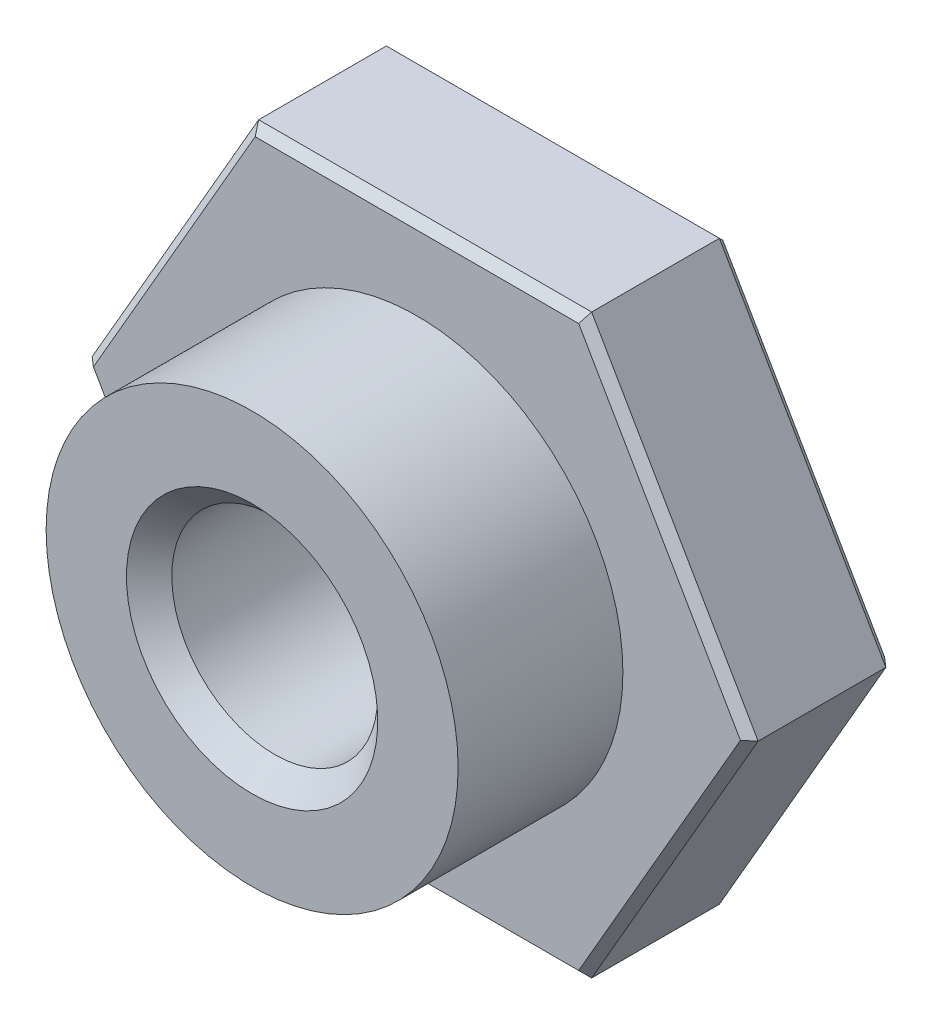
ISO-10303-21;
HEADER;
FILE_DESCRIPTION(('STEP AP214'),'2;1');
FILE_NAME('part.step','',(''),(''),'','','');
FILE_SCHEMA(('AUTOMOTIVE_DESIGN { 1 0 10303 214 1 1 1 1 }'));
ENDSEC;
DATA;
#1=APPLICATION_CONTEXT('core data for automotive mechanical design processes');
#2=APPLICATION_PROTOCOL_DEFINITION('international standard','automotive_design',2000,#1);
#3=PRODUCT_CONTEXT('',#1,'mechanical');
#4=PRODUCT('Part','Part','',(#3));
#5=PRODUCT_RELATED_PRODUCT_CATEGORY('part','',(#4));
#6=PRODUCT_DEFINITION_FORMATION('','',#4);
#7=PRODUCT_DEFINITION_CONTEXT('part definition',#1,'design');
#8=PRODUCT_DEFINITION('design','',#6,#7);
#9=PRODUCT_DEFINITION_SHAPE('','',#8);
#10=(LENGTH_UNIT() NAMED_UNIT(*) SI_UNIT(.MILLI.,.METRE.));
#11=(NAMED_UNIT(*) PLANE_ANGLE_UNIT() SI_UNIT($,.RADIAN.));
#12=(NAMED_UNIT(*) SI_UNIT($,.STERADIAN.) SOLID_ANGLE_UNIT());
#13=UNCERTAINTY_MEASURE_WITH_UNIT(LENGTH_MEASURE(1.E-05),#10,'distance_accuracy_value','');
#14=(GEOMETRIC_REPRESENTATION_CONTEXT(3) GLOBAL_UNCERTAINTY_ASSIGNED_CONTEXT((#13)) GLOBAL_UNIT_ASSIGNED_CONTEXT((#10,
#11,#12)) REPRESENTATION_CONTEXT('',''));
#15=CARTESIAN_POINT('',(0.,0.,0.));
#16=DIRECTION('',(0.,0.,1.));
#17=DIRECTION('',(1.,0.,0.));
#18=AXIS2_PLACEMENT_3D('',#15,#16,#17);
#19=CARTESIAN_POINT('',(0.,0.,3.75));
#20=DIRECTION('',(0.,0.,-1.));
#21=DIRECTION('',(-1.,0.,0.));
#22=AXIS2_PLACEMENT_3D('',#19,#20,#21);
#23=CYLINDRICAL_SURFACE('',#22,2.5);
#24=CARTESIAN_POINT('',(0.,0.,1.75));
#25=DIRECTION('',(0.,0.,-1.));
#26=DIRECTION('',(-1.,0.,0.));
#27=AXIS2_PLACEMENT_3D('',#24,#25,#26);
#28=CIRCLE('',#27,2.5);
#29=CARTESIAN_POINT('',(-2.5,0.,1.75));
#30=VERTEX_POINT('',#29);
#31=EDGE_CURVE('E19',#30,#30,#28,.T.);
#32=ORIENTED_EDGE('',*,*,#31,.F.);
#33=EDGE_LOOP('',(#32));
#34=FACE_BOUND('',#33,.T.);
#35=CARTESIAN_POINT('',(0.,0.,3.75));
#36=DIRECTION('',(0.,0.,-1.));
#37=DIRECTION('',(-1.,0.,0.));
#38=AXIS2_PLACEMENT_3D('',#35,#36,#37);
#39=CIRCLE('',#38,2.5);
#40=CARTESIAN_POINT('',(-2.5,0.,3.75));
#41=VERTEX_POINT('',#40);
#42=EDGE_CURVE('E118',#41,#41,#39,.F.);
#43=ORIENTED_EDGE('',*,*,#42,.F.);
#44=EDGE_LOOP('',(#43));
#45=FACE_BOUND('',#44,.T.);
#46=ADVANCED_FACE('F16',(#34,#45),#23,.T.);
#47=CARTESIAN_POINT('',(0.,0.,1.75));
#48=DIRECTION('',(0.,0.,1.));
#49=DIRECTION('',(1.,0.,0.));
#50=AXIS2_PLACEMENT_3D('',#47,#48,#49);
#51=PLANE('',#50);
#52=ORIENTED_EDGE('',*,*,#31,.T.);
#53=EDGE_LOOP('',(#52));
#54=FACE_BOUND('',#53,.T.);
#55=DIRECTION('',(1.,0.,0.));
#56=VECTOR('',#55,1.);
#57=CARTESIAN_POINT('',(0.,-3.4,1.75));
#58=LINE('',#57,#56);
#59=CARTESIAN_POINT('',(1.96299091524473,-3.4,1.75));
#60=VERTEX_POINT('',#59);
#61=CARTESIAN_POINT('',(-1.96299091524473,-3.4,1.75));
#62=VERTEX_POINT('',#61);
#63=EDGE_CURVE('E111',#60,#62,#58,.F.);
#64=ORIENTED_EDGE('',*,*,#63,.F.);
#65=DIRECTION('',(-0.5,-0.866025403784438,0.));
#66=VECTOR('',#65,1.);
#67=CARTESIAN_POINT('',(3.92598183048946,0.,1.75));
#68=LINE('',#67,#66);
#69=CARTESIAN_POINT('',(3.92598183048946,0.,1.75));
#70=VERTEX_POINT('',#69);
#71=EDGE_CURVE('E108',#70,#60,#68,.T.);
#72=ORIENTED_EDGE('',*,*,#71,.F.);
#73=DIRECTION('',(0.5,-0.866025403784439,0.));
#74=VECTOR('',#73,1.);
#75=CARTESIAN_POINT('',(1.96299091524473,3.4,1.75));
#76=LINE('',#75,#74);
#77=CARTESIAN_POINT('',(1.96299091524473,3.4,1.75));
#78=VERTEX_POINT('',#77);
#79=EDGE_CURVE('E105',#78,#70,#76,.T.);
#80=ORIENTED_EDGE('',*,*,#79,.F.);
#81=DIRECTION('',(1.,0.,0.));
#82=VECTOR('',#81,1.);
#83=CARTESIAN_POINT('',(0.,3.4,1.75));
#84=LINE('',#83,#82);
#85=CARTESIAN_POINT('',(-1.96299091524473,3.4,1.75));
#86=VERTEX_POINT('',#85);
#87=EDGE_CURVE('E292',#86,#78,#84,.T.);
#88=ORIENTED_EDGE('',*,*,#87,.F.);
#89=DIRECTION('',(0.5,0.866025403784439,0.));
#90=VECTOR('',#89,1.);
#91=CARTESIAN_POINT('',(-3.92598183048946,0.,1.75));
#92=LINE('',#91,#90);
#93=CARTESIAN_POINT('',(-3.92598183048946,0.,1.75));
#94=VERTEX_POINT('',#93);
#95=EDGE_CURVE('E289',#94,#86,#92,.T.);
#96=ORIENTED_EDGE('',*,*,#95,.F.);
#97=DIRECTION('',(-0.5,0.866025403784439,0.));
#98=VECTOR('',#97,1.);
#99=CARTESIAN_POINT('',(-1.96299091524473,-3.4,1.75));
#100=LINE('',#99,#98);
#101=EDGE_CURVE('E283',#62,#94,#100,.T.);
#102=ORIENTED_EDGE('',*,*,#101,.F.);
#103=EDGE_LOOP('',(#64,#72,#80,#88,#96,#102));
#104=FACE_BOUND('',#103,.T.);
#105=ADVANCED_FACE('F109',(#54,#104),#51,.T.);
#106=CARTESIAN_POINT('',(0.,0.,3.75));
#107=DIRECTION('',(0.,0.,1.));
#108=DIRECTION('',(1.,0.,0.));
#109=AXIS2_PLACEMENT_3D('',#106,#107,#108);
#110=PLANE('',#109);
#111=ORIENTED_EDGE('',*,*,#42,.T.);
#112=EDGE_LOOP('',(#111));
#113=FACE_BOUND('',#112,.T.);
#114=CARTESIAN_POINT('',(0.,0.,3.75000000002501));
#115=DIRECTION('',(0.,0.,1.));
#116=DIRECTION('',(0.,-1.,0.));
#117=AXIS2_PLACEMENT_3D('',#114,#115,#116);
#118=CIRCLE('',#117,1.52499999995825);
#119=CARTESIAN_POINT('',(0.,-1.52499999995825,3.75000000002501));
#120=VERTEX_POINT('',#119);
#121=EDGE_CURVE('E139',#120,#120,#118,.F.);
#122=ORIENTED_EDGE('',*,*,#121,.T.);
#123=EDGE_LOOP('',(#122));
#124=FACE_BOUND('',#123,.T.);
#125=ADVANCED_FACE('F160',(#113,#124),#110,.T.);
#126=CARTESIAN_POINT('',(2.94448637286709,-1.7,1.75));
#127=DIRECTION('',(0.612372435695797,-0.353553390593275,0.707106781186545));
#128=DIRECTION('',(0.755928946018452,0.,-0.65465367070798));
#129=AXIS2_PLACEMENT_3D('',#126,#127,#128);
#130=PLANE('',#129);
#131=DIRECTION('',(0.75592894601845,0.,-0.654653670707982));
#132=VECTOR('',#131,1.);
#133=CARTESIAN_POINT('',(3.36512728327668,0.,2.23571428571429));
#134=LINE('',#133,#132);
#135=CARTESIAN_POINT('',(4.04145188432738,0.,1.65));
#136=VERTEX_POINT('',#135);
#137=EDGE_CURVE('E117',#70,#136,#134,.T.);
#138=ORIENTED_EDGE('',*,*,#137,.F.);
#139=ORIENTED_EDGE('',*,*,#71,.T.);
#140=DIRECTION('',(-0.377964473009232,0.654653670707973,0.654653670707978));
#141=VECTOR('',#140,1.);
#142=CARTESIAN_POINT('',(2.02072594216369,-3.5,1.65));
#143=LINE('',#142,#141);
#144=CARTESIAN_POINT('',(2.02072594216369,-3.5,1.65));
#145=VERTEX_POINT('',#144);
#146=EDGE_CURVE('E275',#145,#60,#143,.T.);
#147=ORIENTED_EDGE('',*,*,#146,.F.);
#148=DIRECTION('',(-0.5,-0.866025403784439,0.));
#149=VECTOR('',#148,1.);
#150=CARTESIAN_POINT('',(2.02072594216369,-3.5,1.65));
#151=LINE('',#150,#149);
#152=EDGE_CURVE('E130',#145,#136,#151,.F.);
#153=ORIENTED_EDGE('',*,*,#152,.T.);
#154=EDGE_LOOP('',(#138,#139,#147,#153));
#155=FACE_BOUND('',#154,.T.);
#156=ADVANCED_FACE('F129',(#155),#130,.T.);
#157=CARTESIAN_POINT('',(2.94448637286709,1.7,1.75));
#158=DIRECTION('',(0.612372435695799,0.353553390593276,0.707106781186543));
#159=DIRECTION('',(0.75592894601845,0.,-0.654653670707982));
#160=AXIS2_PLACEMENT_3D('',#157,#158,#159);
#161=PLANE('',#160);
#162=DIRECTION('',(0.377964473009223,0.654653670707976,-0.654653670707981));
#163=VECTOR('',#162,1.);
#164=CARTESIAN_POINT('',(1.96299091524473,3.4,1.75));
#165=LINE('',#164,#163);
#166=CARTESIAN_POINT('',(2.02072594216369,3.5,1.65));
#167=VERTEX_POINT('',#166);
#168=EDGE_CURVE('E125',#78,#167,#165,.T.);
#169=ORIENTED_EDGE('',*,*,#168,.F.);
#170=ORIENTED_EDGE('',*,*,#79,.T.);
#171=ORIENTED_EDGE('',*,*,#137,.T.);
#172=DIRECTION('',(0.5,-0.866025403784439,0.));
#173=VECTOR('',#172,1.);
#174=CARTESIAN_POINT('',(4.04145188432738,0.,1.65));
#175=LINE('',#174,#173);
#176=EDGE_CURVE('E310',#136,#167,#175,.F.);
#177=ORIENTED_EDGE('',*,*,#176,.T.);
#178=EDGE_LOOP('',(#169,#170,#171,#177));
#179=FACE_BOUND('',#178,.T.);
#180=ADVANCED_FACE('F122',(#179),#161,.T.);
#181=CARTESIAN_POINT('',(0.,3.4,1.75));
#182=DIRECTION('',(0.,0.707106781186551,0.707106781186544));
#183=DIRECTION('',(0.,-0.707106781186544,0.707106781186551));
#184=AXIS2_PLACEMENT_3D('',#181,#182,#183);
#185=PLANE('',#184);
#186=DIRECTION('',(-0.377964473009226,0.654653670707975,-0.65465367070798));
#187=VECTOR('',#186,1.);
#188=CARTESIAN_POINT('',(-1.96299091524473,3.4,1.75));
#189=LINE('',#188,#187);
#190=CARTESIAN_POINT('',(-2.02072594216369,3.5,1.65));
#191=VERTEX_POINT('',#190);
#192=EDGE_CURVE('E286',#86,#191,#189,.T.);
#193=ORIENTED_EDGE('',*,*,#192,.F.);
#194=ORIENTED_EDGE('',*,*,#87,.T.);
#195=ORIENTED_EDGE('',*,*,#168,.T.);
#196=DIRECTION('',(1.,0.,0.));
#197=VECTOR('',#196,1.);
#198=CARTESIAN_POINT('',(2.02072594216369,3.5,1.65));
#199=LINE('',#198,#197);
#200=EDGE_CURVE('E300',#167,#191,#199,.F.);
#201=ORIENTED_EDGE('',*,*,#200,.T.);
#202=EDGE_LOOP('',(#193,#194,#195,#201));
#203=FACE_BOUND('',#202,.T.);
#204=ADVANCED_FACE('F240',(#203),#185,.T.);
#205=CARTESIAN_POINT('',(-2.94448637286709,1.7,1.75));
#206=DIRECTION('',(-0.612372435695797,0.353553390593276,0.707106781186544));
#207=DIRECTION('',(0.755928946018451,0.,0.654653670707981));
#208=AXIS2_PLACEMENT_3D('',#205,#206,#207);
#209=PLANE('',#208);
#210=ORIENTED_EDGE('',*,*,#192,.T.);
#211=DIRECTION('',(0.5,0.866025403784439,0.));
#212=VECTOR('',#211,1.);
#213=CARTESIAN_POINT('',(-2.02072594216369,3.5,1.65));
#214=LINE('',#213,#212);
#215=CARTESIAN_POINT('',(-4.04145188432738,0.,1.65));
#216=VERTEX_POINT('',#215);
#217=EDGE_CURVE('E316',#191,#216,#214,.F.);
#218=ORIENTED_EDGE('',*,*,#217,.T.);
#219=DIRECTION('',(0.755928946018453,0.,0.65465367070798));
#220=VECTOR('',#219,1.);
#221=CARTESIAN_POINT('',(-3.36512728327668,0.,2.23571428571429));
#222=LINE('',#221,#220);
#223=EDGE_CURVE('E280',#94,#216,#222,.F.);
#224=ORIENTED_EDGE('',*,*,#223,.F.);
#225=ORIENTED_EDGE('',*,*,#95,.T.);
#226=EDGE_LOOP('',(#210,#218,#224,#225));
#227=FACE_BOUND('',#226,.T.);
#228=ADVANCED_FACE('F236',(#227),#209,.T.);
#229=CARTESIAN_POINT('',(-2.94448637286709,-1.7,1.75));
#230=DIRECTION('',(-0.612372435695797,-0.353553390593275,0.707106781186545));
#231=DIRECTION('',(0.755928946018453,0.,0.65465367070798));
#232=AXIS2_PLACEMENT_3D('',#229,#230,#231);
#233=PLANE('',#232);
#234=ORIENTED_EDGE('',*,*,#223,.T.);
#235=DIRECTION('',(-0.5,0.866025403784439,0.));
#236=VECTOR('',#235,1.);
#237=CARTESIAN_POINT('',(-4.04145188432738,0.,1.65));
#238=LINE('',#237,#236);
#239=CARTESIAN_POINT('',(-2.02072594216369,-3.5,1.65));
#240=VERTEX_POINT('',#239);
#241=EDGE_CURVE('E351',#216,#240,#238,.F.);
#242=ORIENTED_EDGE('',*,*,#241,.T.);
#243=DIRECTION('',(-0.37796447300923,-0.654653670707973,-0.654653670707979));
#244=VECTOR('',#243,1.);
#245=CARTESIAN_POINT('',(-1.96299091524473,-3.4,1.75));
#246=LINE('',#245,#244);
#247=EDGE_CURVE('E277',#62,#240,#246,.T.);
#248=ORIENTED_EDGE('',*,*,#247,.F.);
#249=ORIENTED_EDGE('',*,*,#101,.T.);
#250=EDGE_LOOP('',(#234,#242,#248,#249));
#251=FACE_BOUND('',#250,.T.);
#252=ADVANCED_FACE('F232',(#251),#233,.T.);
#253=CARTESIAN_POINT('',(0.,-3.4,1.75));
#254=DIRECTION('',(0.,-0.707106781186551,0.707106781186544));
#255=DIRECTION('',(0.,-0.707106781186544,-0.707106781186551));
#256=AXIS2_PLACEMENT_3D('',#253,#254,#255);
#257=PLANE('',#256);
#258=ORIENTED_EDGE('',*,*,#146,.T.);
#259=ORIENTED_EDGE('',*,*,#63,.T.);
#260=ORIENTED_EDGE('',*,*,#247,.T.);
#261=DIRECTION('',(-1.,0.,0.));
#262=VECTOR('',#261,1.);
#263=CARTESIAN_POINT('',(-2.02072594216369,-3.5,1.65));
#264=LINE('',#263,#262);
#265=EDGE_CURVE('E343',#240,#145,#264,.F.);
#266=ORIENTED_EDGE('',*,*,#265,.T.);
#267=EDGE_LOOP('',(#258,#259,#260,#266));
#268=FACE_BOUND('',#267,.T.);
#269=ADVANCED_FACE('F228',(#268),#257,.T.);
#270=CARTESIAN_POINT('',(0.,0.,3.75000000002501));
#271=DIRECTION('',(0.,0.,1.));
#272=DIRECTION('',(0.,-1.,0.));
#273=AXIS2_PLACEMENT_3D('',#270,#271,#272);
#274=CONICAL_SURFACE('',#273,1.52499999995825,0.785398163397448);
#275=ORIENTED_EDGE('',*,*,#121,.F.);
#276=EDGE_LOOP('',(#275));
#277=FACE_BOUND('',#276,.T.);
#278=CARTESIAN_POINT('',(0.,0.,3.47499999999999));
#279=DIRECTION('',(0.,0.,1.));
#280=DIRECTION('',(1.,0.,0.));
#281=AXIS2_PLACEMENT_3D('',#278,#279,#280);
#282=CIRCLE('',#281,1.24999999999999);
#283=CARTESIAN_POINT('',(1.24999999999999,0.,3.47499999999999));
#284=VERTEX_POINT('',#283);
#285=EDGE_CURVE('E257',#284,#284,#282,.F.);
#286=ORIENTED_EDGE('',*,*,#285,.T.);
#287=EDGE_LOOP('',(#286));
#288=FACE_BOUND('',#287,.T.);
#289=ADVANCED_FACE('F224',(#277,#288),#274,.F.);
#290=CARTESIAN_POINT('',(2.02072594216369,-3.5,1.75));
#291=DIRECTION('',(-0.866025403784439,0.5,0.));
#292=DIRECTION('',(-0.5,-0.866025403784439,0.));
#293=AXIS2_PLACEMENT_3D('',#290,#291,#292);
#294=PLANE('',#293);
#295=DIRECTION('',(0.5,0.866025403784438,0.));
#296=VECTOR('',#295,1.);
#297=CARTESIAN_POINT('',(2.02072594216369,-3.5,0.0999999999999994));
#298=LINE('',#297,#296);
#299=CARTESIAN_POINT('',(2.02072594216369,-3.5,0.0999999999999989));
#300=VERTEX_POINT('',#299);
#301=CARTESIAN_POINT('',(4.04145188432738,0.,0.0999999999999991));
#302=VERTEX_POINT('',#301);
#303=EDGE_CURVE('E258',#300,#302,#298,.T.);
#304=ORIENTED_EDGE('',*,*,#303,.T.);
#305=DIRECTION('',(0.,0.,1.));
#306=VECTOR('',#305,1.);
#307=CARTESIAN_POINT('',(4.04145188432738,0.,1.75));
#308=LINE('',#307,#306);
#309=EDGE_CURVE('E308',#302,#136,#308,.T.);
#310=ORIENTED_EDGE('',*,*,#309,.T.);
#311=ORIENTED_EDGE('',*,*,#152,.F.);
#312=DIRECTION('',(0.,0.,1.));
#313=VECTOR('',#312,1.);
#314=CARTESIAN_POINT('',(2.02072594216369,-3.5,1.75));
#315=LINE('',#314,#313);
#316=EDGE_CURVE('E268',#145,#300,#315,.F.);
#317=ORIENTED_EDGE('',*,*,#316,.T.);
#318=EDGE_LOOP('',(#304,#310,#311,#317));
#319=FACE_BOUND('',#318,.T.);
#320=ADVANCED_FACE('F220',(#319),#294,.F.);
#321=CARTESIAN_POINT('',(4.04145188432738,0.,1.75));
#322=DIRECTION('',(-0.866025403784439,-0.5,0.));
#323=DIRECTION('',(0.5,-0.866025403784439,0.));
#324=AXIS2_PLACEMENT_3D('',#321,#322,#323);
#325=PLANE('',#324);
#326=DIRECTION('',(-0.5,0.866025403784439,0.));
#327=VECTOR('',#326,1.);
#328=CARTESIAN_POINT('',(4.04145188432738,0.,0.0999999999999994));
#329=LINE('',#328,#327);
#330=CARTESIAN_POINT('',(2.02072594216369,3.5,0.0999999999999994));
#331=VERTEX_POINT('',#330);
#332=EDGE_CURVE('E264',#302,#331,#329,.T.);
#333=ORIENTED_EDGE('',*,*,#332,.T.);
#334=DIRECTION('',(0.,0.,-1.));
#335=VECTOR('',#334,1.);
#336=CARTESIAN_POINT('',(2.02072594216369,3.5,1.75));
#337=LINE('',#336,#335);
#338=EDGE_CURVE('E304',#331,#167,#337,.F.);
#339=ORIENTED_EDGE('',*,*,#338,.T.);
#340=ORIENTED_EDGE('',*,*,#176,.F.);
#341=ORIENTED_EDGE('',*,*,#309,.F.);
#342=EDGE_LOOP('',(#333,#339,#340,#341));
#343=FACE_BOUND('',#342,.T.);
#344=ADVANCED_FACE('F216',(#343),#325,.F.);
#345=CARTESIAN_POINT('',(2.02072594216369,3.5,1.75));
#346=DIRECTION('',(0.,-1.,0.));
#347=DIRECTION('',(0.,0.,-1.));
#348=AXIS2_PLACEMENT_3D('',#345,#346,#347);
#349=PLANE('',#348);
#350=DIRECTION('',(1.,0.,0.));
#351=VECTOR('',#350,1.);
#352=CARTESIAN_POINT('',(2.02072594216369,3.5,0.0999999999999994));
#353=LINE('',#352,#351);
#354=CARTESIAN_POINT('',(-2.02072594216369,3.5,0.0999999999999991));
#355=VERTEX_POINT('',#354);
#356=EDGE_CURVE('E333',#331,#355,#353,.F.);
#357=ORIENTED_EDGE('',*,*,#356,.T.);
#358=DIRECTION('',(0.,0.,1.));
#359=VECTOR('',#358,1.);
#360=CARTESIAN_POINT('',(-2.02072594216369,3.5,1.75));
#361=LINE('',#360,#359);
#362=EDGE_CURVE('E306',#355,#191,#361,.T.);
#363=ORIENTED_EDGE('',*,*,#362,.T.);
#364=ORIENTED_EDGE('',*,*,#200,.F.);
#365=ORIENTED_EDGE('',*,*,#338,.F.);
#366=EDGE_LOOP('',(#357,#363,#364,#365));
#367=FACE_BOUND('',#366,.T.);
#368=ADVANCED_FACE('F212',(#367),#349,.F.);
#369=CARTESIAN_POINT('',(-2.02072594216369,3.5,1.75));
#370=DIRECTION('',(0.866025403784439,-0.5,0.));
#371=DIRECTION('',(0.5,0.866025403784439,0.));
#372=AXIS2_PLACEMENT_3D('',#369,#370,#371);
#373=PLANE('',#372);
#374=DIRECTION('',(-0.5,-0.866025403784438,0.));
#375=VECTOR('',#374,1.);
#376=CARTESIAN_POINT('',(-2.02072594216369,3.5,0.0999999999999994));
#377=LINE('',#376,#375);
#378=CARTESIAN_POINT('',(-4.04145188432738,0.,0.0999999999999991));
#379=VERTEX_POINT('',#378);
#380=EDGE_CURVE('E361',#355,#379,#377,.T.);
#381=ORIENTED_EDGE('',*,*,#380,.T.);
#382=DIRECTION('',(0.,0.,1.));
#383=VECTOR('',#382,1.);
#384=CARTESIAN_POINT('',(-4.04145188432738,0.,1.75));
#385=LINE('',#384,#383);
#386=EDGE_CURVE('E347',#379,#216,#385,.T.);
#387=ORIENTED_EDGE('',*,*,#386,.T.);
#388=ORIENTED_EDGE('',*,*,#217,.F.);
#389=ORIENTED_EDGE('',*,*,#362,.F.);
#390=EDGE_LOOP('',(#381,#387,#388,#389));
#391=FACE_BOUND('',#390,.T.);
#392=ADVANCED_FACE('F208',(#391),#373,.F.);
#393=CARTESIAN_POINT('',(-4.04145188432738,0.,1.75));
#394=DIRECTION('',(0.866025403784439,0.5,0.));
#395=DIRECTION('',(-0.5,0.866025403784439,0.));
#396=AXIS2_PLACEMENT_3D('',#393,#394,#395);
#397=PLANE('',#396);
#398=DIRECTION('',(0.5,-0.866025403784439,0.));
#399=VECTOR('',#398,1.);
#400=CARTESIAN_POINT('',(-4.04145188432738,0.,0.0999999999999994));
#401=LINE('',#400,#399);
#402=CARTESIAN_POINT('',(-2.02072594216369,-3.5,0.0999999999999994));
#403=VERTEX_POINT('',#402);
#404=EDGE_CURVE('E357',#379,#403,#401,.T.);
#405=ORIENTED_EDGE('',*,*,#404,.T.);
#406=DIRECTION('',(0.,0.,1.));
#407=VECTOR('',#406,1.);
#408=CARTESIAN_POINT('',(-2.02072594216369,-3.5,1.75));
#409=LINE('',#408,#407);
#410=EDGE_CURVE('E259',#403,#240,#409,.T.);
#411=ORIENTED_EDGE('',*,*,#410,.T.);
#412=ORIENTED_EDGE('',*,*,#241,.F.);
#413=ORIENTED_EDGE('',*,*,#386,.F.);
#414=EDGE_LOOP('',(#405,#411,#412,#413));
#415=FACE_BOUND('',#414,.T.);
#416=ADVANCED_FACE('F204',(#415),#397,.F.);
#417=CARTESIAN_POINT('',(-2.02072594216369,-3.5,1.75));
#418=DIRECTION('',(0.,1.,0.));
#419=DIRECTION('',(-1.,0.,0.));
#420=AXIS2_PLACEMENT_3D('',#417,#418,#419);
#421=PLANE('',#420);
#422=DIRECTION('',(1.,0.,0.));
#423=VECTOR('',#422,1.);
#424=CARTESIAN_POINT('',(-2.02072594216369,-3.5,0.0999999999999994));
#425=LINE('',#424,#423);
#426=EDGE_CURVE('E373',#403,#300,#425,.T.);
#427=ORIENTED_EDGE('',*,*,#426,.T.);
#428=ORIENTED_EDGE('',*,*,#316,.F.);
#429=ORIENTED_EDGE('',*,*,#265,.F.);
#430=ORIENTED_EDGE('',*,*,#410,.F.);
#431=EDGE_LOOP('',(#427,#428,#429,#430));
#432=FACE_BOUND('',#431,.T.);
#433=ADVANCED_FACE('F200',(#432),#421,.F.);
#434=CARTESIAN_POINT('',(0.,0.,3.75));
#435=DIRECTION('',(0.,0.,1.));
#436=DIRECTION('',(1.,0.,0.));
#437=AXIS2_PLACEMENT_3D('',#434,#435,#436);
#438=CYLINDRICAL_SURFACE('',#437,1.24999999999999);
#439=ORIENTED_EDGE('',*,*,#285,.F.);
#440=EDGE_LOOP('',(#439));
#441=FACE_BOUND('',#440,.T.);
#442=CARTESIAN_POINT('',(0.,0.,0.275000000044656));
#443=DIRECTION('',(0.,0.,-1.));
#444=DIRECTION('',(-1.,0.,0.));
#445=AXIS2_PLACEMENT_3D('',#442,#443,#444);
#446=CIRCLE('',#445,1.25000000002728);
#447=CARTESIAN_POINT('',(-1.25000000002728,0.,0.275000000044656));
#448=VERTEX_POINT('',#447);
#449=EDGE_CURVE('E337',#448,#448,#446,.T.);
#450=ORIENTED_EDGE('',*,*,#449,.T.);
#451=EDGE_LOOP('',(#450));
#452=FACE_BOUND('',#451,.T.);
#453=ADVANCED_FACE('F196',(#441,#452),#438,.F.);
#454=CARTESIAN_POINT('',(2.02072594216369,-3.5,0.0999999999999994));
#455=DIRECTION('',(-0.612372435695794,0.353553390593274,0.707106781186547));
#456=DIRECTION('',(0.755928946018454,0.,0.654653670707977));
#457=AXIS2_PLACEMENT_3D('',#454,#455,#456);
#458=PLANE('',#457);
#459=ORIENTED_EDGE('',*,*,#303,.F.);
#460=DIRECTION('',(-0.377964473009233,0.654653670707975,-0.654653670707975));
#461=VECTOR('',#460,1.);
#462=CARTESIAN_POINT('',(2.02072594216369,-3.5,0.0999999999999994));
#463=LINE('',#462,#461);
#464=CARTESIAN_POINT('',(1.96299091524473,-3.4,0.));
#465=VERTEX_POINT('',#464);
#466=EDGE_CURVE('E340',#300,#465,#463,.T.);
#467=ORIENTED_EDGE('',*,*,#466,.T.);
#468=DIRECTION('',(0.5,0.866025403784438,0.));
#469=VECTOR('',#468,1.);
#470=CARTESIAN_POINT('',(1.96299091524473,-3.4,0.));
#471=LINE('',#470,#469);
#472=CARTESIAN_POINT('',(3.92598183048946,0.,0.));
#473=VERTEX_POINT('',#472);
#474=EDGE_CURVE('E339',#465,#473,#471,.T.);
#475=ORIENTED_EDGE('',*,*,#474,.T.);
#476=DIRECTION('',(0.755928946018455,0.,0.654653670707977));
#477=VECTOR('',#476,1.);
#478=CARTESIAN_POINT('',(4.04145188432738,0.,0.0999999999999994));
#479=LINE('',#478,#477);
#480=EDGE_CURVE('E329',#473,#302,#479,.T.);
#481=ORIENTED_EDGE('',*,*,#480,.T.);
#482=EDGE_LOOP('',(#459,#467,#475,#481));
#483=FACE_BOUND('',#482,.T.);
#484=ADVANCED_FACE('F192',(#483),#458,.F.);
#485=CARTESIAN_POINT('',(4.04145188432738,0.,0.0999999999999994));
#486=DIRECTION('',(-0.612372435695794,-0.353553390593274,0.707106781186548));
#487=DIRECTION('',(0.755928946018455,0.,0.654653670707977));
#488=AXIS2_PLACEMENT_3D('',#485,#486,#487);
#489=PLANE('',#488);
#490=DIRECTION('',(-0.5,0.866025403784439,0.));
#491=VECTOR('',#490,1.);
#492=CARTESIAN_POINT('',(3.92598183048946,0.,0.));
#493=LINE('',#492,#491);
#494=CARTESIAN_POINT('',(1.96299091524473,3.4,0.));
#495=VERTEX_POINT('',#494);
#496=EDGE_CURVE('E395',#473,#495,#493,.T.);
#497=ORIENTED_EDGE('',*,*,#496,.T.);
#498=DIRECTION('',(0.377964473009226,0.654653670707978,0.654653670707977));
#499=VECTOR('',#498,1.);
#500=CARTESIAN_POINT('',(1.96299091524473,3.4,0.));
#501=LINE('',#500,#499);
#502=EDGE_CURVE('E331',#495,#331,#501,.T.);
#503=ORIENTED_EDGE('',*,*,#502,.T.);
#504=ORIENTED_EDGE('',*,*,#332,.F.);
#505=ORIENTED_EDGE('',*,*,#480,.F.);
#506=EDGE_LOOP('',(#497,#503,#504,#505));
#507=FACE_BOUND('',#506,.T.);
#508=ADVANCED_FACE('F188',(#507),#489,.F.);
#509=CARTESIAN_POINT('',(2.02072594216369,3.5,0.0999999999999994));
#510=DIRECTION('',(0.,-0.707106781186548,0.707106781186548));
#511=DIRECTION('',(0.,-0.707106781186548,-0.707106781186548));
#512=AXIS2_PLACEMENT_3D('',#509,#510,#511);
#513=PLANE('',#512);
#514=DIRECTION('',(1.,0.,0.));
#515=VECTOR('',#514,1.);
#516=CARTESIAN_POINT('',(0.,3.4,0.));
#517=LINE('',#516,#515);
#518=CARTESIAN_POINT('',(-1.96299091524473,3.4,0.));
#519=VERTEX_POINT('',#518);
#520=EDGE_CURVE('E388',#495,#519,#517,.F.);
#521=ORIENTED_EDGE('',*,*,#520,.T.);
#522=DIRECTION('',(-0.377964473009231,0.654653670707974,0.654653670707978));
#523=VECTOR('',#522,1.);
#524=CARTESIAN_POINT('',(-1.96299091524473,3.4,0.));
#525=LINE('',#524,#523);
#526=EDGE_CURVE('E376',#519,#355,#525,.T.);
#527=ORIENTED_EDGE('',*,*,#526,.T.);
#528=ORIENTED_EDGE('',*,*,#356,.F.);
#529=ORIENTED_EDGE('',*,*,#502,.F.);
#530=EDGE_LOOP('',(#521,#527,#528,#529));
#531=FACE_BOUND('',#530,.T.);
#532=ADVANCED_FACE('F184',(#531),#513,.F.);
#533=CARTESIAN_POINT('',(-2.02072594216369,3.5,0.0999999999999994));
#534=DIRECTION('',(0.612372435695794,-0.353553390593274,0.707106781186547));
#535=DIRECTION('',(0.755928946018454,0.,-0.654653670707977));
#536=AXIS2_PLACEMENT_3D('',#533,#534,#535);
#537=PLANE('',#536);
#538=DIRECTION('',(-0.5,-0.866025403784439,0.));
#539=VECTOR('',#538,1.);
#540=CARTESIAN_POINT('',(-1.96299091524473,3.4,0.));
#541=LINE('',#540,#539);
#542=CARTESIAN_POINT('',(-3.92598183048946,0.,0.));
#543=VERTEX_POINT('',#542);
#544=EDGE_CURVE('E366',#519,#543,#541,.T.);
#545=ORIENTED_EDGE('',*,*,#544,.T.);
#546=DIRECTION('',(0.755928946018454,0.,-0.654653670707978));
#547=VECTOR('',#546,1.);
#548=CARTESIAN_POINT('',(-4.04145188432738,0.,0.0999999999999995));
#549=LINE('',#548,#547);
#550=EDGE_CURVE('E368',#543,#379,#549,.F.);
#551=ORIENTED_EDGE('',*,*,#550,.T.);
#552=ORIENTED_EDGE('',*,*,#380,.F.);
#553=ORIENTED_EDGE('',*,*,#526,.F.);
#554=EDGE_LOOP('',(#545,#551,#552,#553));
#555=FACE_BOUND('',#554,.T.);
#556=ADVANCED_FACE('F180',(#555),#537,.F.);
#557=CARTESIAN_POINT('',(-4.04145188432738,0.,0.0999999999999994));
#558=DIRECTION('',(0.612372435695795,0.353553390593274,0.707106781186547));
#559=DIRECTION('',(0.755928946018454,0.,-0.654653670707978));
#560=AXIS2_PLACEMENT_3D('',#557,#558,#559);
#561=PLANE('',#560);
#562=DIRECTION('',(0.5,-0.866025403784439,0.));
#563=VECTOR('',#562,1.);
#564=CARTESIAN_POINT('',(-3.92598183048946,0.,0.));
#565=LINE('',#564,#563);
#566=CARTESIAN_POINT('',(-1.96299091524473,-3.4,0.));
#567=VERTEX_POINT('',#566);
#568=EDGE_CURVE('E363',#543,#567,#565,.T.);
#569=ORIENTED_EDGE('',*,*,#568,.T.);
#570=DIRECTION('',(-0.377964473009228,-0.654653670707977,0.654653670707977));
#571=VECTOR('',#570,1.);
#572=CARTESIAN_POINT('',(-1.96299091524473,-3.4,0.));
#573=LINE('',#572,#571);
#574=EDGE_CURVE('E35',#567,#403,#573,.T.);
#575=ORIENTED_EDGE('',*,*,#574,.T.);
#576=ORIENTED_EDGE('',*,*,#404,.F.);
#577=ORIENTED_EDGE('',*,*,#550,.F.);
#578=EDGE_LOOP('',(#569,#575,#576,#577));
#579=FACE_BOUND('',#578,.T.);
#580=ADVANCED_FACE('F177',(#579),#561,.F.);
#581=CARTESIAN_POINT('',(-2.02072594216369,-3.5,0.0999999999999994));
#582=DIRECTION('',(0.,0.707106781186548,0.707106781186548));
#583=DIRECTION('',(0.,-0.707106781186548,0.707106781186548));
#584=AXIS2_PLACEMENT_3D('',#581,#582,#583);
#585=PLANE('',#584);
#586=ORIENTED_EDGE('',*,*,#426,.F.);
#587=ORIENTED_EDGE('',*,*,#574,.F.);
#588=DIRECTION('',(1.,0.,0.));
#589=VECTOR('',#588,1.);
#590=CARTESIAN_POINT('',(0.,-3.4,0.));
#591=LINE('',#590,#589);
#592=EDGE_CURVE('E26',#567,#465,#591,.T.);
#593=ORIENTED_EDGE('',*,*,#592,.T.);
#594=ORIENTED_EDGE('',*,*,#466,.F.);
#595=EDGE_LOOP('',(#586,#587,#593,#594));
#596=FACE_BOUND('',#595,.T.);
#597=ADVANCED_FACE('F169',(#596),#585,.F.);
#598=CARTESIAN_POINT('',(0.,0.,5.6843418860808E-11));
#599=DIRECTION('',(0.,0.,-1.));
#600=DIRECTION('',(-1.,0.,0.));
#601=AXIS2_PLACEMENT_3D('',#598,#599,#600);
#602=CONICAL_SURFACE('',#601,1.5250000000151,0.785398163397448);
#603=CARTESIAN_POINT('',(0.,0.,5.6843418860808E-11));
#604=DIRECTION('',(0.,0.,-1.));
#605=DIRECTION('',(-1.,0.,0.));
#606=AXIS2_PLACEMENT_3D('',#603,#604,#605);
#607=CIRCLE('',#606,1.5250000000151);
#608=CARTESIAN_POINT('',(-1.5250000000151,0.,5.6843418860808E-11));
#609=VERTEX_POINT('',#608);
#610=EDGE_CURVE('E11',#609,#609,#607,.T.);
#611=ORIENTED_EDGE('',*,*,#610,.T.);
#612=EDGE_LOOP('',(#611));
#613=FACE_BOUND('',#612,.T.);
#614=ORIENTED_EDGE('',*,*,#449,.F.);
#615=EDGE_LOOP('',(#614));
#616=FACE_BOUND('',#615,.T.);
#617=ADVANCED_FACE('F163',(#613,#616),#602,.F.);
#618=CARTESIAN_POINT('',(0.,0.,0.));
#619=DIRECTION('',(0.,0.,1.));
#620=DIRECTION('',(1.,0.,0.));
#621=AXIS2_PLACEMENT_3D('',#618,#619,#620);
#622=PLANE('',#621);
#623=ORIENTED_EDGE('',*,*,#610,.F.);
#624=EDGE_LOOP('',(#623));
#625=FACE_BOUND('',#624,.T.);
#626=ORIENTED_EDGE('',*,*,#568,.F.);
#627=ORIENTED_EDGE('',*,*,#544,.F.);
#628=ORIENTED_EDGE('',*,*,#520,.F.);
#629=ORIENTED_EDGE('',*,*,#496,.F.);
#630=ORIENTED_EDGE('',*,*,#474,.F.);
#631=ORIENTED_EDGE('',*,*,#592,.F.);
#632=EDGE_LOOP('',(#626,#627,#628,#629,#630,#631));
#633=FACE_BOUND('',#632,.T.);
#634=ADVANCED_FACE('F161',(#625,#633),#622,.F.);
#635=CLOSED_SHELL('',(#46,#105,#125,#156,#180,#204,#228,#252,#269,#289,#320,#344,#368,#392,#416,
#433,#453,#484,#508,#532,#556,#580,#597,#617,#634));
#636=MANIFOLD_SOLID_BREP('B1',#635);
#637=ADVANCED_BREP_SHAPE_REPRESENTATION('',(#18,#636),#14);
#638=SHAPE_DEFINITION_REPRESENTATION(#9,#637);
ENDSEC;
END-ISO-10303-21;
